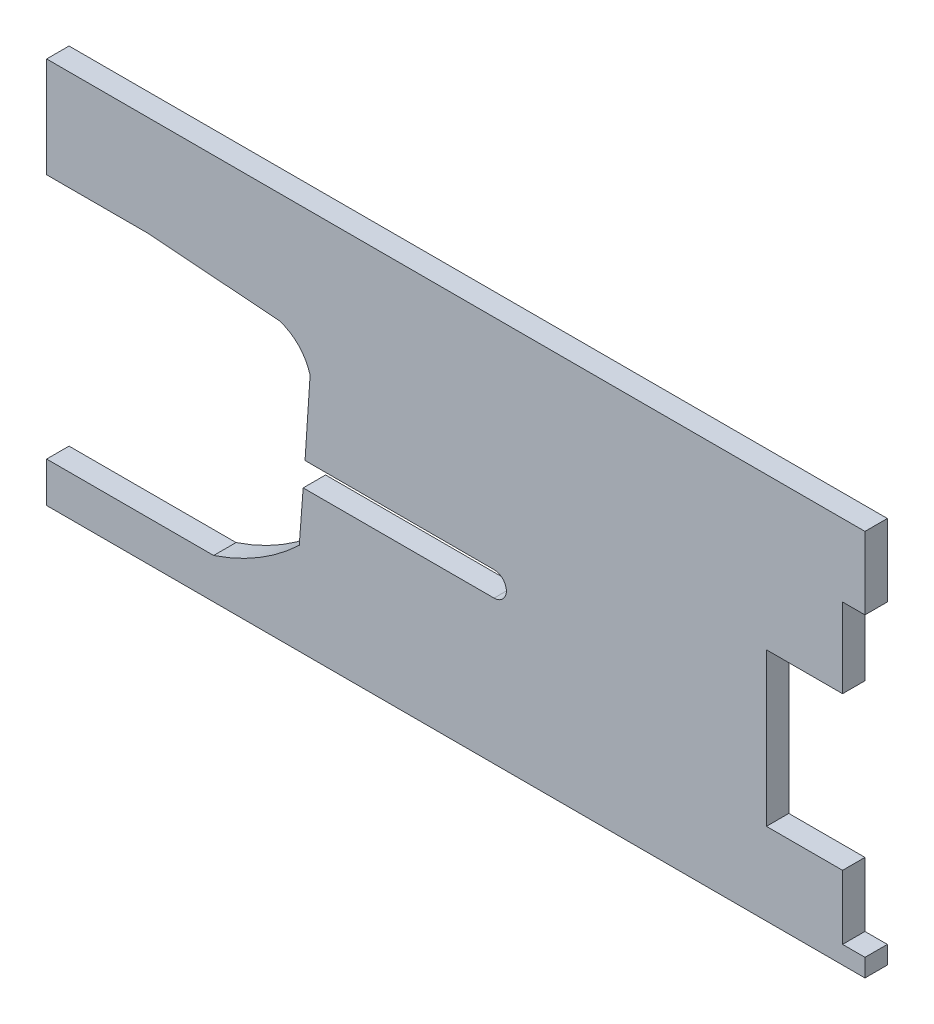
ISO-10303-21;
HEADER;
FILE_DESCRIPTION(('STEP AP214'),'2;1');
FILE_NAME('part.step','',(''),(''),'','','');
FILE_SCHEMA(('AUTOMOTIVE_DESIGN { 1 0 10303 214 1 1 1 1 }'));
ENDSEC;
DATA;
#1=APPLICATION_CONTEXT('core data for automotive mechanical design processes');
#2=APPLICATION_PROTOCOL_DEFINITION('international standard','automotive_design',2000,#1);
#3=PRODUCT_CONTEXT('',#1,'mechanical');
#4=PRODUCT('Part','Part','',(#3));
#5=PRODUCT_RELATED_PRODUCT_CATEGORY('part','',(#4));
#6=PRODUCT_DEFINITION_FORMATION('','',#4);
#7=PRODUCT_DEFINITION_CONTEXT('part definition',#1,'design');
#8=PRODUCT_DEFINITION('design','',#6,#7);
#9=PRODUCT_DEFINITION_SHAPE('','',#8);
#10=(LENGTH_UNIT() NAMED_UNIT(*) SI_UNIT(.MILLI.,.METRE.));
#11=(NAMED_UNIT(*) PLANE_ANGLE_UNIT() SI_UNIT($,.RADIAN.));
#12=(NAMED_UNIT(*) SI_UNIT($,.STERADIAN.) SOLID_ANGLE_UNIT());
#13=UNCERTAINTY_MEASURE_WITH_UNIT(LENGTH_MEASURE(1.E-05),#10,'distance_accuracy_value','');
#14=(GEOMETRIC_REPRESENTATION_CONTEXT(3) GLOBAL_UNCERTAINTY_ASSIGNED_CONTEXT((#13)) GLOBAL_UNIT_ASSIGNED_CONTEXT((#10,
#11,#12)) REPRESENTATION_CONTEXT('',''));
#15=CARTESIAN_POINT('',(0.,0.,0.));
#16=DIRECTION('',(0.,0.,1.));
#17=DIRECTION('',(1.,0.,0.));
#18=AXIS2_PLACEMENT_3D('',#15,#16,#17);
#19=CARTESIAN_POINT('',(0.,70.2030219051761,5.));
#20=DIRECTION('',(-1.,0.,0.));
#21=DIRECTION('',(0.,-1.,0.));
#22=AXIS2_PLACEMENT_3D('',#19,#20,#21);
#23=PLANE('',#22);
#24=DIRECTION('',(0.,1.,0.));
#25=VECTOR('',#24,1.);
#26=CARTESIAN_POINT('',(0.,70.2030219051761,0.));
#27=LINE('',#26,#25);
#28=CARTESIAN_POINT('',(0.,70.2030219051761,0.));
#29=VERTEX_POINT('',#28);
#30=CARTESIAN_POINT('',(0.,86.3508861339649,0.));
#31=VERTEX_POINT('',#30);
#32=EDGE_CURVE('E221',#29,#31,#27,.T.);
#33=ORIENTED_EDGE('',*,*,#32,.T.);
#34=DIRECTION('',(0.,0.,-1.));
#35=VECTOR('',#34,1.);
#36=CARTESIAN_POINT('',(0.,86.3508861339649,5.));
#37=LINE('',#36,#35);
#38=CARTESIAN_POINT('',(0.,86.3508861339649,5.));
#39=VERTEX_POINT('',#38);
#40=EDGE_CURVE('E11',#39,#31,#37,.T.);
#41=ORIENTED_EDGE('',*,*,#40,.F.);
#42=DIRECTION('',(0.,1.,0.));
#43=VECTOR('',#42,1.);
#44=CARTESIAN_POINT('',(0.,70.2030219051761,5.));
#45=LINE('',#44,#43);
#46=CARTESIAN_POINT('',(0.,70.2030219051761,5.));
#47=VERTEX_POINT('',#46);
#48=EDGE_CURVE('E267',#47,#39,#45,.T.);
#49=ORIENTED_EDGE('',*,*,#48,.F.);
#50=DIRECTION('',(0.,0.,-1.));
#51=VECTOR('',#50,1.);
#52=CARTESIAN_POINT('',(0.,70.2030219051761,5.));
#53=LINE('',#52,#51);
#54=EDGE_CURVE('E217',#47,#29,#53,.T.);
#55=ORIENTED_EDGE('',*,*,#54,.T.);
#56=EDGE_LOOP('',(#33,#41,#49,#55));
#57=FACE_BOUND('',#56,.T.);
#58=ADVANCED_FACE('F35',(#57),#23,.F.);
#59=CARTESIAN_POINT('',(-182.7,86.3508861339649,5.));
#60=DIRECTION('',(0.,-1.,0.));
#61=DIRECTION('',(0.,0.,-1.));
#62=AXIS2_PLACEMENT_3D('',#59,#60,#61);
#63=PLANE('',#62);
#64=DIRECTION('',(-1.,0.,0.));
#65=VECTOR('',#64,1.);
#66=CARTESIAN_POINT('',(-182.7,86.3508861339649,0.));
#67=LINE('',#66,#65);
#68=CARTESIAN_POINT('',(-182.7,86.3508861339649,0.));
#69=VERTEX_POINT('',#68);
#70=EDGE_CURVE('E224',#31,#69,#67,.T.);
#71=ORIENTED_EDGE('',*,*,#70,.T.);
#72=DIRECTION('',(0.,0.,-1.));
#73=VECTOR('',#72,1.);
#74=CARTESIAN_POINT('',(-182.7,86.3508861339649,5.));
#75=LINE('',#74,#73);
#76=CARTESIAN_POINT('',(-182.7,86.3508861339649,5.));
#77=VERTEX_POINT('',#76);
#78=EDGE_CURVE('E43',#77,#69,#75,.T.);
#79=ORIENTED_EDGE('',*,*,#78,.F.);
#80=DIRECTION('',(-1.,0.,0.));
#81=VECTOR('',#80,1.);
#82=CARTESIAN_POINT('',(-182.7,86.3508861339649,5.));
#83=LINE('',#82,#81);
#84=EDGE_CURVE('E139',#39,#77,#83,.T.);
#85=ORIENTED_EDGE('',*,*,#84,.F.);
#86=ORIENTED_EDGE('',*,*,#40,.T.);
#87=EDGE_LOOP('',(#71,#79,#85,#86));
#88=FACE_BOUND('',#87,.T.);
#89=ADVANCED_FACE('F400',(#88),#63,.F.);
#90=CARTESIAN_POINT('',(-182.7,63.9489617699978,5.));
#91=DIRECTION('',(1.,0.,0.));
#92=DIRECTION('',(0.,1.,0.));
#93=AXIS2_PLACEMENT_3D('',#90,#91,#92);
#94=PLANE('',#93);
#95=DIRECTION('',(0.,-1.,0.));
#96=VECTOR('',#95,1.);
#97=CARTESIAN_POINT('',(-182.7,63.9489617699978,0.));
#98=LINE('',#97,#96);
#99=CARTESIAN_POINT('',(-182.7,63.9489617699978,0.));
#100=VERTEX_POINT('',#99);
#101=EDGE_CURVE('E226',#69,#100,#98,.T.);
#102=ORIENTED_EDGE('',*,*,#101,.T.);
#103=DIRECTION('',(0.,0.,-1.));
#104=VECTOR('',#103,1.);
#105=CARTESIAN_POINT('',(-182.7,63.9489617699978,5.));
#106=LINE('',#105,#104);
#107=CARTESIAN_POINT('',(-182.7,63.9489617699978,5.));
#108=VERTEX_POINT('',#107);
#109=EDGE_CURVE('E319',#108,#100,#106,.T.);
#110=ORIENTED_EDGE('',*,*,#109,.F.);
#111=DIRECTION('',(0.,-1.,0.));
#112=VECTOR('',#111,1.);
#113=CARTESIAN_POINT('',(-182.7,63.9489617699978,5.));
#114=LINE('',#113,#112);
#115=EDGE_CURVE('E327',#77,#108,#114,.T.);
#116=ORIENTED_EDGE('',*,*,#115,.F.);
#117=ORIENTED_EDGE('',*,*,#78,.T.);
#118=EDGE_LOOP('',(#102,#110,#116,#117));
#119=FACE_BOUND('',#118,.T.);
#120=ADVANCED_FACE('F325',(#119),#94,.F.);
#121=CARTESIAN_POINT('',(-182.7,63.9489617699978,5.));
#122=DIRECTION('',(0.,1.,0.));
#123=DIRECTION('',(0.,0.,1.));
#124=AXIS2_PLACEMENT_3D('',#121,#122,#123);
#125=PLANE('',#124);
#126=DIRECTION('',(1.,0.,0.));
#127=VECTOR('',#126,1.);
#128=CARTESIAN_POINT('',(-182.7,63.9489617699978,0.));
#129=LINE('',#128,#127);
#130=CARTESIAN_POINT('',(-160.256841341505,63.9489617699978,0.));
#131=VERTEX_POINT('',#130);
#132=EDGE_CURVE('E228',#100,#131,#129,.T.);
#133=ORIENTED_EDGE('',*,*,#132,.T.);
#134=DIRECTION('',(0.,0.,-1.));
#135=VECTOR('',#134,1.);
#136=CARTESIAN_POINT('',(-160.256841341505,63.9489617699978,5.));
#137=LINE('',#136,#135);
#138=CARTESIAN_POINT('',(-160.256841341505,63.9489617699978,5.));
#139=VERTEX_POINT('',#138);
#140=EDGE_CURVE('E316',#139,#131,#137,.T.);
#141=ORIENTED_EDGE('',*,*,#140,.F.);
#142=DIRECTION('',(1.,0.,0.));
#143=VECTOR('',#142,1.);
#144=CARTESIAN_POINT('',(-182.7,63.9489617699978,5.));
#145=LINE('',#144,#143);
#146=EDGE_CURVE('E345',#108,#139,#145,.T.);
#147=ORIENTED_EDGE('',*,*,#146,.F.);
#148=ORIENTED_EDGE('',*,*,#109,.T.);
#149=EDGE_LOOP('',(#133,#141,#147,#148));
#150=FACE_BOUND('',#149,.T.);
#151=ADVANCED_FACE('F336',(#150),#125,.F.);
#152=CARTESIAN_POINT('',(-160.256841341505,63.9489617699978,5.));
#153=DIRECTION('',(0.0756132209423929,0.997137222662316,0.));
#154=DIRECTION('',(-0.997137222662316,0.0756132209423929,0.));
#155=AXIS2_PLACEMENT_3D('',#152,#153,#154);
#156=PLANE('',#155);
#157=DIRECTION('',(0.997137222662316,-0.0756132209423929,0.));
#158=VECTOR('',#157,1.);
#159=CARTESIAN_POINT('',(-160.256841341505,63.9489617699978,0.));
#160=LINE('',#159,#158);
#161=CARTESIAN_POINT('',(-130.724497171668,61.7095150680699,0.));
#162=VERTEX_POINT('',#161);
#163=EDGE_CURVE('E230',#131,#162,#160,.T.);
#164=ORIENTED_EDGE('',*,*,#163,.T.);
#165=DIRECTION('',(0.,0.,-1.));
#166=VECTOR('',#165,1.);
#167=CARTESIAN_POINT('',(-130.724497171668,61.7095150680699,5.));
#168=LINE('',#167,#166);
#169=CARTESIAN_POINT('',(-130.724497171668,61.7095150680699,5.));
#170=VERTEX_POINT('',#169);
#171=EDGE_CURVE('E313',#170,#162,#168,.T.);
#172=ORIENTED_EDGE('',*,*,#171,.F.);
#173=DIRECTION('',(0.997137222662316,-0.0756132209423929,0.));
#174=VECTOR('',#173,1.);
#175=CARTESIAN_POINT('',(-160.256841341505,63.9489617699978,5.));
#176=LINE('',#175,#174);
#177=EDGE_CURVE('E342',#139,#170,#176,.T.);
#178=ORIENTED_EDGE('',*,*,#177,.F.);
#179=ORIENTED_EDGE('',*,*,#140,.T.);
#180=EDGE_LOOP('',(#164,#172,#178,#179));
#181=FACE_BOUND('',#180,.T.);
#182=ADVANCED_FACE('F340',(#181),#156,.F.);
#183=CARTESIAN_POINT('',(-133.818157322966,51.8684094824912,5.));
#184=DIRECTION('',(0.,0.,-1.));
#185=DIRECTION('',(-1.,0.,0.));
#186=AXIS2_PLACEMENT_3D('',#183,#184,#185);
#187=CYLINDRICAL_SURFACE('',#186,10.3159145148764);
#188=CARTESIAN_POINT('',(-133.818157322966,51.8684094824912,0.));
#189=DIRECTION('',(0.,0.,-1.));
#190=DIRECTION('',(1.,0.,0.));
#191=AXIS2_PLACEMENT_3D('',#188,#189,#190);
#192=CIRCLE('',#191,10.3159145148764);
#193=CARTESIAN_POINT('',(-123.878576155163,54.6293546986968,0.));
#194=VERTEX_POINT('',#193);
#195=EDGE_CURVE('E232',#162,#194,#192,.T.);
#196=ORIENTED_EDGE('',*,*,#195,.T.);
#197=DIRECTION('',(0.,0.,-1.));
#198=VECTOR('',#197,1.);
#199=CARTESIAN_POINT('',(-123.878576155163,54.6293546986968,5.));
#200=LINE('',#199,#198);
#201=CARTESIAN_POINT('',(-123.878576155163,54.6293546986968,5.));
#202=VERTEX_POINT('',#201);
#203=EDGE_CURVE('E310',#202,#194,#200,.T.);
#204=ORIENTED_EDGE('',*,*,#203,.F.);
#205=CARTESIAN_POINT('',(-133.818157322966,51.8684094824912,5.));
#206=DIRECTION('',(0.,0.,-1.));
#207=DIRECTION('',(1.,0.,0.));
#208=AXIS2_PLACEMENT_3D('',#205,#206,#207);
#209=CIRCLE('',#208,10.3159145148764);
#210=EDGE_CURVE('E344',#170,#202,#209,.T.);
#211=ORIENTED_EDGE('',*,*,#210,.F.);
#212=ORIENTED_EDGE('',*,*,#171,.T.);
#213=EDGE_LOOP('',(#196,#204,#211,#212));
#214=FACE_BOUND('',#213,.T.);
#215=ADVANCED_FACE('F413',(#214),#187,.F.);
#216=CARTESIAN_POINT('',(-125.01141830883,37.548381086818,5.));
#217=DIRECTION('',(0.997807933473384,-0.0661764905202305,0.));
#218=DIRECTION('',(0.0661764905202305,0.997807933473384,0.));
#219=AXIS2_PLACEMENT_3D('',#216,#217,#218);
#220=PLANE('',#219);
#221=DIRECTION('',(-0.0661764905202305,-0.997807933473384,0.));
#222=VECTOR('',#221,1.);
#223=CARTESIAN_POINT('',(-125.01141830883,37.548381086818,0.));
#224=LINE('',#223,#222);
#225=CARTESIAN_POINT('',(-125.01141830883,37.548381086818,0.));
#226=VERTEX_POINT('',#225);
#227=EDGE_CURVE('E234',#194,#226,#224,.T.);
#228=ORIENTED_EDGE('',*,*,#227,.T.);
#229=DIRECTION('',(0.,0.,-1.));
#230=VECTOR('',#229,1.);
#231=CARTESIAN_POINT('',(-125.01141830883,37.548381086818,5.));
#232=LINE('',#231,#230);
#233=CARTESIAN_POINT('',(-125.01141830883,37.548381086818,5.));
#234=VERTEX_POINT('',#233);
#235=EDGE_CURVE('E307',#234,#226,#232,.T.);
#236=ORIENTED_EDGE('',*,*,#235,.F.);
#237=DIRECTION('',(-0.0661764905202305,-0.997807933473384,0.));
#238=VECTOR('',#237,1.);
#239=CARTESIAN_POINT('',(-125.01141830883,37.548381086818,5.));
#240=LINE('',#239,#238);
#241=EDGE_CURVE('E347',#202,#234,#240,.T.);
#242=ORIENTED_EDGE('',*,*,#241,.F.);
#243=ORIENTED_EDGE('',*,*,#203,.T.);
#244=EDGE_LOOP('',(#228,#236,#242,#243));
#245=FACE_BOUND('',#244,.T.);
#246=ADVANCED_FACE('F416',(#245),#220,.F.);
#247=CARTESIAN_POINT('',(-125.01141830883,37.548381086818,5.));
#248=DIRECTION('',(0.,1.,0.));
#249=DIRECTION('',(0.,0.,1.));
#250=AXIS2_PLACEMENT_3D('',#247,#248,#249);
#251=PLANE('',#250);
#252=DIRECTION('',(1.,0.,0.));
#253=VECTOR('',#252,1.);
#254=CARTESIAN_POINT('',(-125.01141830883,37.548381086818,0.));
#255=LINE('',#254,#253);
#256=CARTESIAN_POINT('',(-82.8102231584948,37.548381086818,0.));
#257=VERTEX_POINT('',#256);
#258=EDGE_CURVE('E236',#226,#257,#255,.T.);
#259=ORIENTED_EDGE('',*,*,#258,.T.);
#260=DIRECTION('',(0.,0.,-1.));
#261=VECTOR('',#260,1.);
#262=CARTESIAN_POINT('',(-82.8102231584948,37.548381086818,5.));
#263=LINE('',#262,#261);
#264=CARTESIAN_POINT('',(-82.8102231584948,37.548381086818,5.));
#265=VERTEX_POINT('',#264);
#266=EDGE_CURVE('E304',#265,#257,#263,.T.);
#267=ORIENTED_EDGE('',*,*,#266,.F.);
#268=DIRECTION('',(1.,0.,0.));
#269=VECTOR('',#268,1.);
#270=CARTESIAN_POINT('',(-125.01141830883,37.548381086818,5.));
#271=LINE('',#270,#269);
#272=EDGE_CURVE('E353',#234,#265,#271,.T.);
#273=ORIENTED_EDGE('',*,*,#272,.F.);
#274=ORIENTED_EDGE('',*,*,#235,.T.);
#275=EDGE_LOOP('',(#259,#267,#273,#274));
#276=FACE_BOUND('',#275,.T.);
#277=ADVANCED_FACE('F420',(#276),#251,.F.);
#278=CARTESIAN_POINT('',(-82.8102231584948,34.798381086818,5.));
#279=DIRECTION('',(0.,0.,-1.));
#280=DIRECTION('',(-1.,0.,0.));
#281=AXIS2_PLACEMENT_3D('',#278,#279,#280);
#282=CYLINDRICAL_SURFACE('',#281,2.75);
#283=CARTESIAN_POINT('',(-82.8102231584948,34.798381086818,0.));
#284=DIRECTION('',(0.,0.,-1.));
#285=DIRECTION('',(1.,0.,0.));
#286=AXIS2_PLACEMENT_3D('',#283,#284,#285);
#287=CIRCLE('',#286,2.75);
#288=CARTESIAN_POINT('',(-82.8102231584948,32.048381086818,0.));
#289=VERTEX_POINT('',#288);
#290=EDGE_CURVE('E238',#257,#289,#287,.T.);
#291=ORIENTED_EDGE('',*,*,#290,.T.);
#292=DIRECTION('',(0.,0.,-1.));
#293=VECTOR('',#292,1.);
#294=CARTESIAN_POINT('',(-82.8102231584948,32.048381086818,5.));
#295=LINE('',#294,#293);
#296=CARTESIAN_POINT('',(-82.8102231584948,32.048381086818,5.));
#297=VERTEX_POINT('',#296);
#298=EDGE_CURVE('E301',#297,#289,#295,.T.);
#299=ORIENTED_EDGE('',*,*,#298,.F.);
#300=CARTESIAN_POINT('',(-82.8102231584948,34.798381086818,5.));
#301=DIRECTION('',(0.,0.,-1.));
#302=DIRECTION('',(1.,0.,0.));
#303=AXIS2_PLACEMENT_3D('',#300,#301,#302);
#304=CIRCLE('',#303,2.75);
#305=EDGE_CURVE('E355',#265,#297,#304,.T.);
#306=ORIENTED_EDGE('',*,*,#305,.F.);
#307=ORIENTED_EDGE('',*,*,#266,.T.);
#308=EDGE_LOOP('',(#291,#299,#306,#307));
#309=FACE_BOUND('',#308,.T.);
#310=ADVANCED_FACE('F424',(#309),#282,.F.);
#311=CARTESIAN_POINT('',(-125.427965276715,32.048381086818,5.));
#312=DIRECTION('',(0.,-1.,0.));
#313=DIRECTION('',(0.,0.,-1.));
#314=AXIS2_PLACEMENT_3D('',#311,#312,#313);
#315=PLANE('',#314);
#316=DIRECTION('',(-1.,0.,0.));
#317=VECTOR('',#316,1.);
#318=CARTESIAN_POINT('',(-125.427965276715,32.048381086818,0.));
#319=LINE('',#318,#317);
#320=CARTESIAN_POINT('',(-125.427965276715,32.048381086818,0.));
#321=VERTEX_POINT('',#320);
#322=EDGE_CURVE('E240',#289,#321,#319,.T.);
#323=ORIENTED_EDGE('',*,*,#322,.T.);
#324=DIRECTION('',(0.,0.,-1.));
#325=VECTOR('',#324,1.);
#326=CARTESIAN_POINT('',(-125.427965276715,32.048381086818,5.));
#327=LINE('',#326,#325);
#328=CARTESIAN_POINT('',(-125.427965276715,32.048381086818,5.));
#329=VERTEX_POINT('',#328);
#330=EDGE_CURVE('E298',#329,#321,#327,.T.);
#331=ORIENTED_EDGE('',*,*,#330,.F.);
#332=DIRECTION('',(-1.,0.,0.));
#333=VECTOR('',#332,1.);
#334=CARTESIAN_POINT('',(-125.427965276715,32.048381086818,5.));
#335=LINE('',#334,#333);
#336=EDGE_CURVE('E357',#297,#329,#335,.T.);
#337=ORIENTED_EDGE('',*,*,#336,.F.);
#338=ORIENTED_EDGE('',*,*,#298,.T.);
#339=EDGE_LOOP('',(#323,#331,#337,#338));
#340=FACE_BOUND('',#339,.T.);
#341=ADVANCED_FACE('F428',(#340),#315,.F.);
#342=CARTESIAN_POINT('',(-125.427965276715,32.048381086818,5.));
#343=DIRECTION('',(0.997144322448147,-0.0755195352834402,0.));
#344=DIRECTION('',(0.0755195352834402,0.997144322448147,0.));
#345=AXIS2_PLACEMENT_3D('',#342,#343,#344);
#346=PLANE('',#345);
#347=DIRECTION('',(-0.0755195352834402,-0.997144322448147,0.));
#348=VECTOR('',#347,1.);
#349=CARTESIAN_POINT('',(-125.427965276715,32.048381086818,0.));
#350=LINE('',#349,#348);
#351=CARTESIAN_POINT('',(-126.301759952318,20.5109769371142,0.));
#352=VERTEX_POINT('',#351);
#353=EDGE_CURVE('E242',#321,#352,#350,.T.);
#354=ORIENTED_EDGE('',*,*,#353,.T.);
#355=DIRECTION('',(0.,0.,-1.));
#356=VECTOR('',#355,1.);
#357=CARTESIAN_POINT('',(-126.301759952318,20.5109769371142,5.));
#358=LINE('',#357,#356);
#359=CARTESIAN_POINT('',(-126.301759952318,20.5109769371142,5.));
#360=VERTEX_POINT('',#359);
#361=EDGE_CURVE('E295',#360,#352,#358,.T.);
#362=ORIENTED_EDGE('',*,*,#361,.F.);
#363=DIRECTION('',(-0.0755195352834402,-0.997144322448147,0.));
#364=VECTOR('',#363,1.);
#365=CARTESIAN_POINT('',(-125.427965276715,32.048381086818,5.));
#366=LINE('',#365,#364);
#367=EDGE_CURVE('E359',#329,#360,#366,.T.);
#368=ORIENTED_EDGE('',*,*,#367,.F.);
#369=ORIENTED_EDGE('',*,*,#330,.T.);
#370=EDGE_LOOP('',(#354,#362,#368,#369));
#371=FACE_BOUND('',#370,.T.);
#372=ADVANCED_FACE('F432',(#371),#346,.F.);
#373=CARTESIAN_POINT('',(-161.573567272045,57.4131153815654,5.));
#374=DIRECTION('',(0.,0.,-1.));
#375=DIRECTION('',(-1.,0.,0.));
#376=AXIS2_PLACEMENT_3D('',#373,#374,#375);
#377=CYLINDRICAL_SURFACE('',#376,51.0477052703979);
#378=CARTESIAN_POINT('',(-161.573567272045,57.4131153815654,0.));
#379=DIRECTION('',(0.,0.,-1.));
#380=DIRECTION('',(1.,0.,0.));
#381=AXIS2_PLACEMENT_3D('',#378,#379,#380);
#382=CIRCLE('',#381,51.0477052703979);
#383=CARTESIAN_POINT('',(-145.410596186743,8.99177113061445,0.));
#384=VERTEX_POINT('',#383);
#385=EDGE_CURVE('E244',#352,#384,#382,.T.);
#386=ORIENTED_EDGE('',*,*,#385,.T.);
#387=DIRECTION('',(0.,0.,-1.));
#388=VECTOR('',#387,1.);
#389=CARTESIAN_POINT('',(-145.410596186743,8.99177113061445,5.));
#390=LINE('',#389,#388);
#391=CARTESIAN_POINT('',(-145.410596186743,8.99177113061445,5.));
#392=VERTEX_POINT('',#391);
#393=EDGE_CURVE('E292',#392,#384,#390,.T.);
#394=ORIENTED_EDGE('',*,*,#393,.F.);
#395=CARTESIAN_POINT('',(-161.573567272045,57.4131153815654,5.));
#396=DIRECTION('',(0.,0.,-1.));
#397=DIRECTION('',(1.,0.,0.));
#398=AXIS2_PLACEMENT_3D('',#395,#396,#397);
#399=CIRCLE('',#398,51.0477052703979);
#400=EDGE_CURVE('E361',#360,#392,#399,.T.);
#401=ORIENTED_EDGE('',*,*,#400,.F.);
#402=ORIENTED_EDGE('',*,*,#361,.T.);
#403=EDGE_LOOP('',(#386,#394,#401,#402));
#404=FACE_BOUND('',#403,.T.);
#405=ADVANCED_FACE('F436',(#404),#377,.F.);
#406=CARTESIAN_POINT('',(-145.410596186743,8.99177113061444,5.));
#407=DIRECTION('',(0.,-1.,0.));
#408=DIRECTION('',(1.,0.,0.));
#409=AXIS2_PLACEMENT_3D('',#406,#407,#408);
#410=PLANE('',#409);
#411=DIRECTION('',(-1.,0.,0.));
#412=VECTOR('',#411,1.);
#413=CARTESIAN_POINT('',(-145.410596186743,8.99177113061444,0.));
#414=LINE('',#413,#412);
#415=CARTESIAN_POINT('',(-182.7,8.99177113061444,0.));
#416=VERTEX_POINT('',#415);
#417=EDGE_CURVE('E246',#384,#416,#414,.T.);
#418=ORIENTED_EDGE('',*,*,#417,.T.);
#419=DIRECTION('',(0.,0.,-1.));
#420=VECTOR('',#419,1.);
#421=CARTESIAN_POINT('',(-182.7,8.99177113061444,5.));
#422=LINE('',#421,#420);
#423=CARTESIAN_POINT('',(-182.7,8.99177113061444,5.));
#424=VERTEX_POINT('',#423);
#425=EDGE_CURVE('E289',#424,#416,#422,.T.);
#426=ORIENTED_EDGE('',*,*,#425,.F.);
#427=DIRECTION('',(-1.,0.,0.));
#428=VECTOR('',#427,1.);
#429=CARTESIAN_POINT('',(-145.410596186743,8.99177113061444,5.));
#430=LINE('',#429,#428);
#431=EDGE_CURVE('E363',#392,#424,#430,.T.);
#432=ORIENTED_EDGE('',*,*,#431,.F.);
#433=ORIENTED_EDGE('',*,*,#393,.T.);
#434=EDGE_LOOP('',(#418,#426,#432,#433));
#435=FACE_BOUND('',#434,.T.);
#436=ADVANCED_FACE('F440',(#435),#410,.F.);
#437=CARTESIAN_POINT('',(-182.7,0.,5.));
#438=DIRECTION('',(1.,0.,0.));
#439=DIRECTION('',(0.,0.,-1.));
#440=AXIS2_PLACEMENT_3D('',#437,#438,#439);
#441=PLANE('',#440);
#442=DIRECTION('',(0.,-1.,0.));
#443=VECTOR('',#442,1.);
#444=CARTESIAN_POINT('',(-182.7,0.,0.));
#445=LINE('',#444,#443);
#446=CARTESIAN_POINT('',(-182.7,0.,0.));
#447=VERTEX_POINT('',#446);
#448=EDGE_CURVE('E248',#416,#447,#445,.T.);
#449=ORIENTED_EDGE('',*,*,#448,.T.);
#450=DIRECTION('',(0.,0.,-1.));
#451=VECTOR('',#450,1.);
#452=CARTESIAN_POINT('',(-182.7,0.,5.));
#453=LINE('',#452,#451);
#454=CARTESIAN_POINT('',(-182.7,0.,5.));
#455=VERTEX_POINT('',#454);
#456=EDGE_CURVE('E286',#455,#447,#453,.T.);
#457=ORIENTED_EDGE('',*,*,#456,.F.);
#458=DIRECTION('',(0.,-1.,0.));
#459=VECTOR('',#458,1.);
#460=CARTESIAN_POINT('',(-182.7,0.,5.));
#461=LINE('',#460,#459);
#462=EDGE_CURVE('E365',#424,#455,#461,.T.);
#463=ORIENTED_EDGE('',*,*,#462,.F.);
#464=ORIENTED_EDGE('',*,*,#425,.T.);
#465=EDGE_LOOP('',(#449,#457,#463,#464));
#466=FACE_BOUND('',#465,.T.);
#467=ADVANCED_FACE('F444',(#466),#441,.F.);
#468=CARTESIAN_POINT('',(-122.533931464021,0.,5.));
#469=DIRECTION('',(0.,1.,0.));
#470=DIRECTION('',(0.,0.,1.));
#471=AXIS2_PLACEMENT_3D('',#468,#469,#470);
#472=PLANE('',#471);
#473=DIRECTION('',(1.,0.,0.));
#474=VECTOR('',#473,1.);
#475=CARTESIAN_POINT('',(-122.533931464021,0.,0.));
#476=LINE('',#475,#474);
#477=CARTESIAN_POINT('',(0.,0.,0.));
#478=VERTEX_POINT('',#477);
#479=EDGE_CURVE('E251',#447,#478,#476,.T.);
#480=ORIENTED_EDGE('',*,*,#479,.T.);
#481=DIRECTION('',(0.,0.,-1.));
#482=VECTOR('',#481,1.);
#483=CARTESIAN_POINT('',(0.,0.,5.));
#484=LINE('',#483,#482);
#485=CARTESIAN_POINT('',(0.,0.,5.));
#486=VERTEX_POINT('',#485);
#487=EDGE_CURVE('E283',#486,#478,#484,.T.);
#488=ORIENTED_EDGE('',*,*,#487,.F.);
#489=DIRECTION('',(1.,0.,0.));
#490=VECTOR('',#489,1.);
#491=CARTESIAN_POINT('',(-122.533931464021,0.,5.));
#492=LINE('',#491,#490);
#493=EDGE_CURVE('E367',#455,#486,#492,.T.);
#494=ORIENTED_EDGE('',*,*,#493,.F.);
#495=ORIENTED_EDGE('',*,*,#456,.T.);
#496=EDGE_LOOP('',(#480,#488,#494,#495));
#497=FACE_BOUND('',#496,.T.);
#498=ADVANCED_FACE('F448',(#497),#472,.F.);
#499=CARTESIAN_POINT('',(0.,0.,5.));
#500=DIRECTION('',(-1.,0.,0.));
#501=DIRECTION('',(0.,-1.,0.));
#502=AXIS2_PLACEMENT_3D('',#499,#500,#501);
#503=PLANE('',#502);
#504=DIRECTION('',(0.,1.,0.));
#505=VECTOR('',#504,1.);
#506=CARTESIAN_POINT('',(0.,0.,0.));
#507=LINE('',#506,#505);
#508=CARTESIAN_POINT('',(0.,4.00000000000011,0.));
#509=VERTEX_POINT('',#508);
#510=EDGE_CURVE('E253',#478,#509,#507,.T.);
#511=ORIENTED_EDGE('',*,*,#510,.T.);
#512=DIRECTION('',(0.,0.,-1.));
#513=VECTOR('',#512,1.);
#514=CARTESIAN_POINT('',(0.,4.00000000000011,5.));
#515=LINE('',#514,#513);
#516=CARTESIAN_POINT('',(0.,4.00000000000011,5.));
#517=VERTEX_POINT('',#516);
#518=EDGE_CURVE('E280',#517,#509,#515,.T.);
#519=ORIENTED_EDGE('',*,*,#518,.F.);
#520=DIRECTION('',(0.,1.,0.));
#521=VECTOR('',#520,1.);
#522=CARTESIAN_POINT('',(0.,0.,5.));
#523=LINE('',#522,#521);
#524=EDGE_CURVE('E369',#486,#517,#523,.T.);
#525=ORIENTED_EDGE('',*,*,#524,.F.);
#526=ORIENTED_EDGE('',*,*,#487,.T.);
#527=EDGE_LOOP('',(#511,#519,#525,#526));
#528=FACE_BOUND('',#527,.T.);
#529=ADVANCED_FACE('F452',(#528),#503,.F.);
#530=CARTESIAN_POINT('',(0.,4.00000000000011,5.));
#531=DIRECTION('',(0.,-1.,0.));
#532=DIRECTION('',(1.,0.,0.));
#533=AXIS2_PLACEMENT_3D('',#530,#531,#532);
#534=PLANE('',#533);
#535=DIRECTION('',(-1.,0.,0.));
#536=VECTOR('',#535,1.);
#537=CARTESIAN_POINT('',(0.,4.00000000000011,0.));
#538=LINE('',#537,#536);
#539=CARTESIAN_POINT('',(-4.99999999999994,4.0000000000001,0.));
#540=VERTEX_POINT('',#539);
#541=EDGE_CURVE('E255',#509,#540,#538,.T.);
#542=ORIENTED_EDGE('',*,*,#541,.T.);
#543=DIRECTION('',(0.,0.,-1.));
#544=VECTOR('',#543,1.);
#545=CARTESIAN_POINT('',(-4.99999999999994,4.0000000000001,5.));
#546=LINE('',#545,#544);
#547=CARTESIAN_POINT('',(-4.99999999999994,4.0000000000001,5.));
#548=VERTEX_POINT('',#547);
#549=EDGE_CURVE('E277',#548,#540,#546,.T.);
#550=ORIENTED_EDGE('',*,*,#549,.F.);
#551=DIRECTION('',(-1.,0.,0.));
#552=VECTOR('',#551,1.);
#553=CARTESIAN_POINT('',(0.,4.00000000000011,5.));
#554=LINE('',#553,#552);
#555=EDGE_CURVE('E371',#517,#548,#554,.T.);
#556=ORIENTED_EDGE('',*,*,#555,.F.);
#557=ORIENTED_EDGE('',*,*,#518,.T.);
#558=EDGE_LOOP('',(#542,#550,#556,#557));
#559=FACE_BOUND('',#558,.T.);
#560=ADVANCED_FACE('F456',(#559),#534,.F.);
#561=CARTESIAN_POINT('',(-4.99999999999994,18.3222498802798,5.));
#562=DIRECTION('',(-1.,0.,0.));
#563=DIRECTION('',(0.,-1.,0.));
#564=AXIS2_PLACEMENT_3D('',#561,#562,#563);
#565=PLANE('',#564);
#566=DIRECTION('',(0.,1.,0.));
#567=VECTOR('',#566,1.);
#568=CARTESIAN_POINT('',(-4.99999999999994,18.3222498802798,0.));
#569=LINE('',#568,#567);
#570=CARTESIAN_POINT('',(-4.99999999999994,18.3222498802798,0.));
#571=VERTEX_POINT('',#570);
#572=EDGE_CURVE('E258',#540,#571,#569,.T.);
#573=ORIENTED_EDGE('',*,*,#572,.T.);
#574=DIRECTION('',(0.,0.,-1.));
#575=VECTOR('',#574,1.);
#576=CARTESIAN_POINT('',(-4.99999999999994,18.3222498802798,5.));
#577=LINE('',#576,#575);
#578=CARTESIAN_POINT('',(-4.99999999999994,18.3222498802798,5.));
#579=VERTEX_POINT('',#578);
#580=EDGE_CURVE('E274',#579,#571,#577,.T.);
#581=ORIENTED_EDGE('',*,*,#580,.F.);
#582=DIRECTION('',(0.,1.,0.));
#583=VECTOR('',#582,1.);
#584=CARTESIAN_POINT('',(-4.99999999999995,8.90261500571586,5.));
#585=LINE('',#584,#583);
#586=EDGE_CURVE('E373',#548,#579,#585,.T.);
#587=ORIENTED_EDGE('',*,*,#586,.F.);
#588=ORIENTED_EDGE('',*,*,#549,.T.);
#589=EDGE_LOOP('',(#573,#581,#587,#588));
#590=FACE_BOUND('',#589,.T.);
#591=ADVANCED_FACE('F460',(#590),#565,.F.);
#592=CARTESIAN_POINT('',(-4.99999999999994,18.3222498802798,5.));
#593=DIRECTION('',(0.,-1.,0.));
#594=DIRECTION('',(1.,0.,0.));
#595=AXIS2_PLACEMENT_3D('',#592,#593,#594);
#596=PLANE('',#595);
#597=DIRECTION('',(-1.,0.,0.));
#598=VECTOR('',#597,1.);
#599=CARTESIAN_POINT('',(-4.99999999999994,18.3222498802798,0.));
#600=LINE('',#599,#598);
#601=CARTESIAN_POINT('',(-22.,18.3222498802798,0.));
#602=VERTEX_POINT('',#601);
#603=EDGE_CURVE('E260',#571,#602,#600,.T.);
#604=ORIENTED_EDGE('',*,*,#603,.T.);
#605=DIRECTION('',(0.,0.,-1.));
#606=VECTOR('',#605,1.);
#607=CARTESIAN_POINT('',(-22.,18.3222498802798,5.));
#608=LINE('',#607,#606);
#609=CARTESIAN_POINT('',(-22.,18.3222498802798,5.));
#610=VERTEX_POINT('',#609);
#611=EDGE_CURVE('E271',#610,#602,#608,.T.);
#612=ORIENTED_EDGE('',*,*,#611,.F.);
#613=DIRECTION('',(-1.,0.,0.));
#614=VECTOR('',#613,1.);
#615=CARTESIAN_POINT('',(-4.99999999999994,18.3222498802798,5.));
#616=LINE('',#615,#614);
#617=EDGE_CURVE('E375',#579,#610,#616,.T.);
#618=ORIENTED_EDGE('',*,*,#617,.F.);
#619=ORIENTED_EDGE('',*,*,#580,.T.);
#620=EDGE_LOOP('',(#604,#612,#618,#619));
#621=FACE_BOUND('',#620,.T.);
#622=ADVANCED_FACE('F381',(#621),#596,.F.);
#623=CARTESIAN_POINT('',(-22.,52.463633889454,5.));
#624=DIRECTION('',(-1.,0.,0.));
#625=DIRECTION('',(0.,-1.,0.));
#626=AXIS2_PLACEMENT_3D('',#623,#624,#625);
#627=PLANE('',#626);
#628=DIRECTION('',(0.,1.,0.));
#629=VECTOR('',#628,1.);
#630=CARTESIAN_POINT('',(-22.,52.463633889454,0.));
#631=LINE('',#630,#629);
#632=CARTESIAN_POINT('',(-22.,52.463633889454,0.));
#633=VERTEX_POINT('',#632);
#634=EDGE_CURVE('E262',#602,#633,#631,.T.);
#635=ORIENTED_EDGE('',*,*,#634,.T.);
#636=DIRECTION('',(0.,0.,-1.));
#637=VECTOR('',#636,1.);
#638=CARTESIAN_POINT('',(-22.,52.463633889454,5.));
#639=LINE('',#638,#637);
#640=CARTESIAN_POINT('',(-22.,52.463633889454,5.));
#641=VERTEX_POINT('',#640);
#642=EDGE_CURVE('E212',#641,#633,#639,.T.);
#643=ORIENTED_EDGE('',*,*,#642,.F.);
#644=DIRECTION('',(0.,1.,0.));
#645=VECTOR('',#644,1.);
#646=CARTESIAN_POINT('',(-22.,52.463633889454,5.));
#647=LINE('',#646,#645);
#648=EDGE_CURVE('E203',#610,#641,#647,.T.);
#649=ORIENTED_EDGE('',*,*,#648,.F.);
#650=ORIENTED_EDGE('',*,*,#611,.T.);
#651=EDGE_LOOP('',(#635,#643,#649,#650));
#652=FACE_BOUND('',#651,.T.);
#653=ADVANCED_FACE('F385',(#652),#627,.F.);
#654=CARTESIAN_POINT('',(-22.,52.463633889454,5.));
#655=DIRECTION('',(0.,1.,0.));
#656=DIRECTION('',(0.,0.,1.));
#657=AXIS2_PLACEMENT_3D('',#654,#655,#656);
#658=PLANE('',#657);
#659=DIRECTION('',(1.,0.,0.));
#660=VECTOR('',#659,1.);
#661=CARTESIAN_POINT('',(-22.,52.463633889454,0.));
#662=LINE('',#661,#660);
#663=CARTESIAN_POINT('',(-4.99999999999995,52.463633889454,0.));
#664=VERTEX_POINT('',#663);
#665=EDGE_CURVE('E211',#633,#664,#662,.T.);
#666=ORIENTED_EDGE('',*,*,#665,.T.);
#667=DIRECTION('',(0.,0.,-1.));
#668=VECTOR('',#667,1.);
#669=CARTESIAN_POINT('',(-4.99999999999995,52.463633889454,5.));
#670=LINE('',#669,#668);
#671=CARTESIAN_POINT('',(-4.99999999999995,52.463633889454,5.));
#672=VERTEX_POINT('',#671);
#673=EDGE_CURVE('E208',#672,#664,#670,.T.);
#674=ORIENTED_EDGE('',*,*,#673,.F.);
#675=DIRECTION('',(1.,0.,0.));
#676=VECTOR('',#675,1.);
#677=CARTESIAN_POINT('',(-22.,52.463633889454,5.));
#678=LINE('',#677,#676);
#679=EDGE_CURVE('E197',#641,#672,#678,.T.);
#680=ORIENTED_EDGE('',*,*,#679,.F.);
#681=ORIENTED_EDGE('',*,*,#642,.T.);
#682=EDGE_LOOP('',(#666,#674,#680,#681));
#683=FACE_BOUND('',#682,.T.);
#684=ADVANCED_FACE('F209',(#683),#658,.F.);
#685=CARTESIAN_POINT('',(-5.,70.2030219051761,5.));
#686=DIRECTION('',(-1.,0.,0.));
#687=DIRECTION('',(0.,-1.,0.));
#688=AXIS2_PLACEMENT_3D('',#685,#686,#687);
#689=PLANE('',#688);
#690=DIRECTION('',(0.,1.,0.));
#691=VECTOR('',#690,1.);
#692=CARTESIAN_POINT('',(-5.,70.2030219051761,0.));
#693=LINE('',#692,#691);
#694=CARTESIAN_POINT('',(-5.,70.2030219051761,0.));
#695=VERTEX_POINT('',#694);
#696=EDGE_CURVE('E125',#664,#695,#693,.T.);
#697=ORIENTED_EDGE('',*,*,#696,.T.);
#698=DIRECTION('',(0.,0.,-1.));
#699=VECTOR('',#698,1.);
#700=CARTESIAN_POINT('',(-5.,70.2030219051761,5.));
#701=LINE('',#700,#699);
#702=CARTESIAN_POINT('',(-5.,70.2030219051761,5.));
#703=VERTEX_POINT('',#702);
#704=EDGE_CURVE('E213',#703,#695,#701,.T.);
#705=ORIENTED_EDGE('',*,*,#704,.F.);
#706=DIRECTION('',(0.,1.,0.));
#707=VECTOR('',#706,1.);
#708=CARTESIAN_POINT('',(-5.,70.2030219051761,5.));
#709=LINE('',#708,#707);
#710=EDGE_CURVE('E201',#672,#703,#709,.T.);
#711=ORIENTED_EDGE('',*,*,#710,.F.);
#712=ORIENTED_EDGE('',*,*,#673,.T.);
#713=EDGE_LOOP('',(#697,#705,#711,#712));
#714=FACE_BOUND('',#713,.T.);
#715=ADVANCED_FACE('F215',(#714),#689,.F.);
#716=CARTESIAN_POINT('',(0.,70.2030219051761,5.));
#717=DIRECTION('',(0.,1.,0.));
#718=DIRECTION('',(0.,0.,1.));
#719=AXIS2_PLACEMENT_3D('',#716,#717,#718);
#720=PLANE('',#719);
#721=DIRECTION('',(1.,0.,0.));
#722=VECTOR('',#721,1.);
#723=CARTESIAN_POINT('',(0.,70.2030219051761,0.));
#724=LINE('',#723,#722);
#725=EDGE_CURVE('E131',#695,#29,#724,.T.);
#726=ORIENTED_EDGE('',*,*,#725,.T.);
#727=ORIENTED_EDGE('',*,*,#54,.F.);
#728=DIRECTION('',(1.,0.,0.));
#729=VECTOR('',#728,1.);
#730=CARTESIAN_POINT('',(0.,70.2030219051761,5.));
#731=LINE('',#730,#729);
#732=EDGE_CURVE('E51',#703,#47,#731,.T.);
#733=ORIENTED_EDGE('',*,*,#732,.F.);
#734=ORIENTED_EDGE('',*,*,#704,.T.);
#735=EDGE_LOOP('',(#726,#727,#733,#734));
#736=FACE_BOUND('',#735,.T.);
#737=ADVANCED_FACE('F389',(#736),#720,.F.);
#738=CARTESIAN_POINT('',(-133.818157322966,51.8684094824912,5.));
#739=DIRECTION('',(0.,0.,1.));
#740=DIRECTION('',(1.,0.,0.));
#741=AXIS2_PLACEMENT_3D('',#738,#739,#740);
#742=PLANE('',#741);
#743=ORIENTED_EDGE('',*,*,#48,.T.);
#744=ORIENTED_EDGE('',*,*,#84,.T.);
#745=ORIENTED_EDGE('',*,*,#115,.T.);
#746=ORIENTED_EDGE('',*,*,#146,.T.);
#747=ORIENTED_EDGE('',*,*,#177,.T.);
#748=ORIENTED_EDGE('',*,*,#210,.T.);
#749=ORIENTED_EDGE('',*,*,#241,.T.);
#750=ORIENTED_EDGE('',*,*,#272,.T.);
#751=ORIENTED_EDGE('',*,*,#305,.T.);
#752=ORIENTED_EDGE('',*,*,#336,.T.);
#753=ORIENTED_EDGE('',*,*,#367,.T.);
#754=ORIENTED_EDGE('',*,*,#400,.T.);
#755=ORIENTED_EDGE('',*,*,#431,.T.);
#756=ORIENTED_EDGE('',*,*,#462,.T.);
#757=ORIENTED_EDGE('',*,*,#493,.T.);
#758=ORIENTED_EDGE('',*,*,#524,.T.);
#759=ORIENTED_EDGE('',*,*,#555,.T.);
#760=ORIENTED_EDGE('',*,*,#586,.T.);
#761=ORIENTED_EDGE('',*,*,#617,.T.);
#762=ORIENTED_EDGE('',*,*,#648,.T.);
#763=ORIENTED_EDGE('',*,*,#679,.T.);
#764=ORIENTED_EDGE('',*,*,#710,.T.);
#765=ORIENTED_EDGE('',*,*,#732,.T.);
#766=EDGE_LOOP('',(#743,#744,#745,#746,#747,#748,#749,#750,#751,#752,#753,#754,#755,#756,#757,
#758,#759,#760,#761,#762,#763,#764,#765));
#767=FACE_BOUND('',#766,.T.);
#768=ADVANCED_FACE('F199',(#767),#742,.T.);
#769=CARTESIAN_POINT('',(-133.818157322966,51.8684094824912,0.));
#770=DIRECTION('',(0.,0.,1.));
#771=DIRECTION('',(1.,0.,0.));
#772=AXIS2_PLACEMENT_3D('',#769,#770,#771);
#773=PLANE('',#772);
#774=ORIENTED_EDGE('',*,*,#32,.F.);
#775=ORIENTED_EDGE('',*,*,#725,.F.);
#776=ORIENTED_EDGE('',*,*,#696,.F.);
#777=ORIENTED_EDGE('',*,*,#665,.F.);
#778=ORIENTED_EDGE('',*,*,#634,.F.);
#779=ORIENTED_EDGE('',*,*,#603,.F.);
#780=ORIENTED_EDGE('',*,*,#572,.F.);
#781=ORIENTED_EDGE('',*,*,#541,.F.);
#782=ORIENTED_EDGE('',*,*,#510,.F.);
#783=ORIENTED_EDGE('',*,*,#479,.F.);
#784=ORIENTED_EDGE('',*,*,#448,.F.);
#785=ORIENTED_EDGE('',*,*,#417,.F.);
#786=ORIENTED_EDGE('',*,*,#385,.F.);
#787=ORIENTED_EDGE('',*,*,#353,.F.);
#788=ORIENTED_EDGE('',*,*,#322,.F.);
#789=ORIENTED_EDGE('',*,*,#290,.F.);
#790=ORIENTED_EDGE('',*,*,#258,.F.);
#791=ORIENTED_EDGE('',*,*,#227,.F.);
#792=ORIENTED_EDGE('',*,*,#195,.F.);
#793=ORIENTED_EDGE('',*,*,#163,.F.);
#794=ORIENTED_EDGE('',*,*,#132,.F.);
#795=ORIENTED_EDGE('',*,*,#101,.F.);
#796=ORIENTED_EDGE('',*,*,#70,.F.);
#797=EDGE_LOOP('',(#774,#775,#776,#777,#778,#779,#780,#781,#782,#783,#784,#785,#786,#787,#788,
#789,#790,#791,#792,#793,#794,#795,#796));
#798=FACE_BOUND('',#797,.T.);
#799=ADVANCED_FACE('F331',(#798),#773,.F.);
#800=CLOSED_SHELL('',(#58,#89,#120,#151,#182,#215,#246,#277,#310,#341,#372,#405,#436,#467,#498,
#529,#560,#591,#622,#653,#684,#715,#737,#768,#799));
#801=MANIFOLD_SOLID_BREP('B2',#800);
#802=ADVANCED_BREP_SHAPE_REPRESENTATION('',(#18,#801),#14);
#803=SHAPE_DEFINITION_REPRESENTATION(#9,#802);
ENDSEC;
END-ISO-10303-21;
